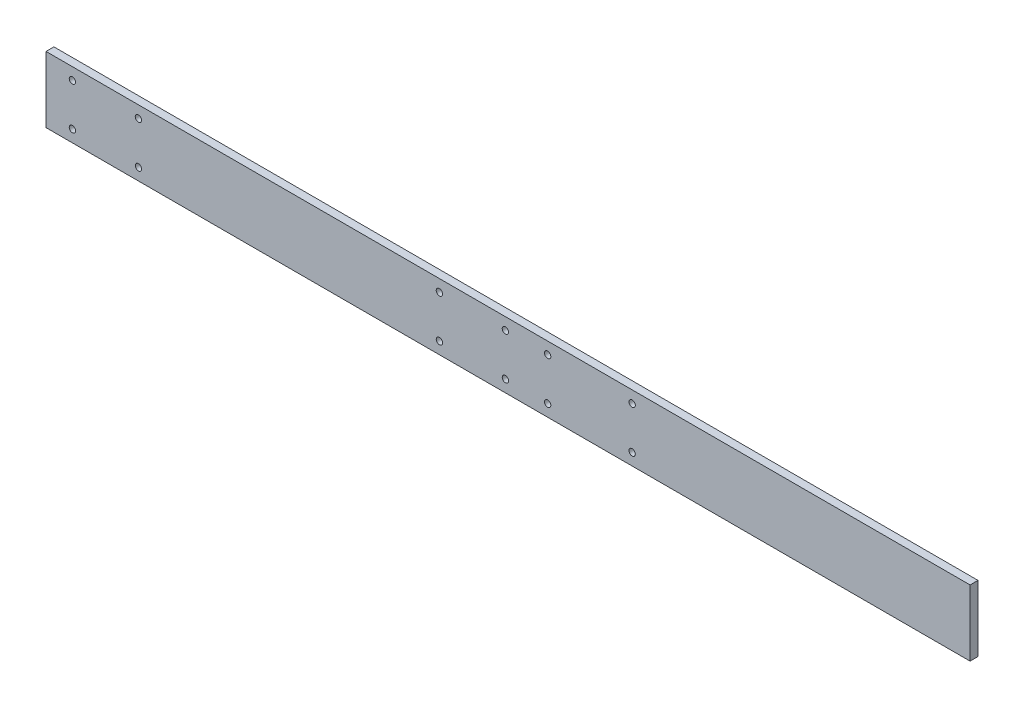
ISO-10303-21;
HEADER;
FILE_DESCRIPTION(('STEP AP214'),'2;1');
FILE_NAME('part.step','',(''),(''),'','','');
FILE_SCHEMA(('AUTOMOTIVE_DESIGN { 1 0 10303 214 1 1 1 1 }'));
ENDSEC;
DATA;
#1=APPLICATION_CONTEXT('core data for automotive mechanical design processes');
#2=APPLICATION_PROTOCOL_DEFINITION('international standard','automotive_design',2000,#1);
#3=PRODUCT_CONTEXT('',#1,'mechanical');
#4=PRODUCT('Part','Part','',(#3));
#5=PRODUCT_RELATED_PRODUCT_CATEGORY('part','',(#4));
#6=PRODUCT_DEFINITION_FORMATION('','',#4);
#7=PRODUCT_DEFINITION_CONTEXT('part definition',#1,'design');
#8=PRODUCT_DEFINITION('design','',#6,#7);
#9=PRODUCT_DEFINITION_SHAPE('','',#8);
#10=(LENGTH_UNIT() NAMED_UNIT(*) SI_UNIT(.MILLI.,.METRE.));
#11=(NAMED_UNIT(*) PLANE_ANGLE_UNIT() SI_UNIT($,.RADIAN.));
#12=(NAMED_UNIT(*) SI_UNIT($,.STERADIAN.) SOLID_ANGLE_UNIT());
#13=UNCERTAINTY_MEASURE_WITH_UNIT(LENGTH_MEASURE(1.E-05),#10,'distance_accuracy_value','');
#14=(GEOMETRIC_REPRESENTATION_CONTEXT(3) GLOBAL_UNCERTAINTY_ASSIGNED_CONTEXT((#13)) GLOBAL_UNIT_ASSIGNED_CONTEXT((#10,
#11,#12)) REPRESENTATION_CONTEXT('',''));
#15=CARTESIAN_POINT('',(0.,0.,0.));
#16=DIRECTION('',(0.,0.,1.));
#17=DIRECTION('',(1.,0.,0.));
#18=AXIS2_PLACEMENT_3D('',#15,#16,#17);
#19=CARTESIAN_POINT('',(0.,1.065814E-13,0.));
#20=DIRECTION('',(0.,0.,1.));
#21=DIRECTION('',(1.,0.,0.));
#22=AXIS2_PLACEMENT_3D('',#19,#20,#21);
#23=PLANE('',#22);
#24=CARTESIAN_POINT('',(150.,-80.,0.));
#25=DIRECTION('',(0.,0.,-1.));
#26=DIRECTION('',(-1.,0.,0.));
#27=AXIS2_PLACEMENT_3D('',#24,#25,#26);
#28=CIRCLE('',#27,12.);
#29=CARTESIAN_POINT('',(138.,-80.,0.));
#30=VERTEX_POINT('',#29);
#31=EDGE_CURVE('E115',#30,#30,#28,.F.);
#32=ORIENTED_EDGE('',*,*,#31,.T.);
#33=EDGE_LOOP('',(#32));
#34=FACE_BOUND('',#33,.T.);
#35=CARTESIAN_POINT('',(470.,-80.0000000000001,0.));
#36=DIRECTION('',(0.,0.,-1.));
#37=DIRECTION('',(-1.,0.,0.));
#38=AXIS2_PLACEMENT_3D('',#35,#36,#37);
#39=CIRCLE('',#38,11.9999999999999);
#40=CARTESIAN_POINT('',(458.,-80.0000000000001,0.));
#41=VERTEX_POINT('',#40);
#42=EDGE_CURVE('E119',#41,#41,#39,.F.);
#43=ORIENTED_EDGE('',*,*,#42,.T.);
#44=EDGE_LOOP('',(#43));
#45=FACE_BOUND('',#44,.T.);
#46=CARTESIAN_POINT('',(150.,80.,0.));
#47=DIRECTION('',(0.,0.,-1.));
#48=DIRECTION('',(-1.,0.,0.));
#49=AXIS2_PLACEMENT_3D('',#46,#47,#48);
#50=CIRCLE('',#49,12.);
#51=CARTESIAN_POINT('',(138.,80.,0.));
#52=VERTEX_POINT('',#51);
#53=EDGE_CURVE('E122',#52,#52,#50,.F.);
#54=ORIENTED_EDGE('',*,*,#53,.T.);
#55=EDGE_LOOP('',(#54));
#56=FACE_BOUND('',#55,.T.);
#57=CARTESIAN_POINT('',(470.,80.,0.));
#58=DIRECTION('',(0.,0.,-1.));
#59=DIRECTION('',(-1.,0.,0.));
#60=AXIS2_PLACEMENT_3D('',#57,#58,#59);
#61=CIRCLE('',#60,11.9999999999999);
#62=CARTESIAN_POINT('',(458.,80.,0.));
#63=VERTEX_POINT('',#62);
#64=EDGE_CURVE('E125',#63,#63,#61,.F.);
#65=ORIENTED_EDGE('',*,*,#64,.T.);
#66=EDGE_LOOP('',(#65));
#67=FACE_BOUND('',#66,.T.);
#68=CARTESIAN_POINT('',(-1650.,-80.0000000000002,0.));
#69=DIRECTION('',(0.,0.,-1.));
#70=DIRECTION('',(-1.,0.,0.));
#71=AXIS2_PLACEMENT_3D('',#68,#69,#70);
#72=CIRCLE('',#71,12.);
#73=CARTESIAN_POINT('',(-1662.,-80.0000000000002,0.));
#74=VERTEX_POINT('',#73);
#75=EDGE_CURVE('E128',#74,#74,#72,.F.);
#76=ORIENTED_EDGE('',*,*,#75,.T.);
#77=EDGE_LOOP('',(#76));
#78=FACE_BOUND('',#77,.T.);
#79=CARTESIAN_POINT('',(-1650.,79.9999999999998,0.));
#80=DIRECTION('',(0.,0.,-1.));
#81=DIRECTION('',(-1.,0.,0.));
#82=AXIS2_PLACEMENT_3D('',#79,#80,#81);
#83=CIRCLE('',#82,11.9999999999999);
#84=CARTESIAN_POINT('',(-1662.,79.9999999999998,0.));
#85=VERTEX_POINT('',#84);
#86=EDGE_CURVE('E131',#85,#85,#83,.F.);
#87=ORIENTED_EDGE('',*,*,#86,.T.);
#88=EDGE_LOOP('',(#87));
#89=FACE_BOUND('',#88,.T.);
#90=CARTESIAN_POINT('',(-1400.,-80.,0.));
#91=DIRECTION('',(0.,0.,-1.));
#92=DIRECTION('',(-1.,0.,0.));
#93=AXIS2_PLACEMENT_3D('',#90,#91,#92);
#94=CIRCLE('',#93,12.);
#95=CARTESIAN_POINT('',(-1412.,-80.,0.));
#96=VERTEX_POINT('',#95);
#97=EDGE_CURVE('E134',#96,#96,#94,.F.);
#98=ORIENTED_EDGE('',*,*,#97,.T.);
#99=EDGE_LOOP('',(#98));
#100=FACE_BOUND('',#99,.T.);
#101=CARTESIAN_POINT('',(-1400.,80.,0.));
#102=DIRECTION('',(0.,0.,-1.));
#103=DIRECTION('',(-1.,0.,0.));
#104=AXIS2_PLACEMENT_3D('',#101,#102,#103);
#105=CIRCLE('',#104,11.9999999999999);
#106=CARTESIAN_POINT('',(-1412.,80.,0.));
#107=VERTEX_POINT('',#106);
#108=EDGE_CURVE('E137',#107,#107,#105,.F.);
#109=ORIENTED_EDGE('',*,*,#108,.T.);
#110=EDGE_LOOP('',(#109));
#111=FACE_BOUND('',#110,.T.);
#112=CARTESIAN_POINT('',(-260.,-79.9999999999998,0.));
#113=DIRECTION('',(0.,0.,-1.));
#114=DIRECTION('',(-1.,0.,0.));
#115=AXIS2_PLACEMENT_3D('',#112,#113,#114);
#116=CIRCLE('',#115,12.);
#117=CARTESIAN_POINT('',(-272.,-79.9999999999998,0.));
#118=VERTEX_POINT('',#117);
#119=EDGE_CURVE('E140',#118,#118,#116,.F.);
#120=ORIENTED_EDGE('',*,*,#119,.T.);
#121=EDGE_LOOP('',(#120));
#122=FACE_BOUND('',#121,.T.);
#123=CARTESIAN_POINT('',(-260.,80.0000000000002,0.));
#124=DIRECTION('',(0.,0.,-1.));
#125=DIRECTION('',(-1.,0.,0.));
#126=AXIS2_PLACEMENT_3D('',#123,#124,#125);
#127=CIRCLE('',#126,12.);
#128=CARTESIAN_POINT('',(-272.,80.0000000000002,0.));
#129=VERTEX_POINT('',#128);
#130=EDGE_CURVE('E143',#129,#129,#127,.F.);
#131=ORIENTED_EDGE('',*,*,#130,.T.);
#132=EDGE_LOOP('',(#131));
#133=FACE_BOUND('',#132,.T.);
#134=CARTESIAN_POINT('',(-10.,-79.9999999999998,0.));
#135=DIRECTION('',(0.,0.,-1.));
#136=DIRECTION('',(-1.,0.,0.));
#137=AXIS2_PLACEMENT_3D('',#134,#135,#136);
#138=CIRCLE('',#137,12.);
#139=CARTESIAN_POINT('',(-22.,-79.9999999999998,0.));
#140=VERTEX_POINT('',#139);
#141=EDGE_CURVE('E145',#140,#140,#138,.F.);
#142=ORIENTED_EDGE('',*,*,#141,.T.);
#143=EDGE_LOOP('',(#142));
#144=FACE_BOUND('',#143,.T.);
#145=CARTESIAN_POINT('',(-10.,80.0000000000002,0.));
#146=DIRECTION('',(0.,0.,-1.));
#147=DIRECTION('',(-1.,0.,0.));
#148=AXIS2_PLACEMENT_3D('',#145,#146,#147);
#149=CIRCLE('',#148,12.);
#150=CARTESIAN_POINT('',(-22.,80.0000000000002,0.));
#151=VERTEX_POINT('',#150);
#152=EDGE_CURVE('E21',#151,#151,#149,.F.);
#153=ORIENTED_EDGE('',*,*,#152,.T.);
#154=EDGE_LOOP('',(#153));
#155=FACE_BOUND('',#154,.T.);
#156=DIRECTION('',(0.,1.,0.));
#157=VECTOR('',#156,1.);
#158=CARTESIAN_POINT('',(1750.,125.,0.));
#159=LINE('',#158,#157);
#160=CARTESIAN_POINT('',(1750.,-125.,0.));
#161=VERTEX_POINT('',#160);
#162=CARTESIAN_POINT('',(1750.,125.,0.));
#163=VERTEX_POINT('',#162);
#164=EDGE_CURVE('E61',#161,#163,#159,.T.);
#165=ORIENTED_EDGE('',*,*,#164,.F.);
#166=DIRECTION('',(1.,0.,0.));
#167=VECTOR('',#166,1.);
#168=CARTESIAN_POINT('',(1750.,-125.,0.));
#169=LINE('',#168,#167);
#170=CARTESIAN_POINT('',(-1750.,-125.,0.));
#171=VERTEX_POINT('',#170);
#172=EDGE_CURVE('E152',#171,#161,#169,.T.);
#173=ORIENTED_EDGE('',*,*,#172,.F.);
#174=DIRECTION('',(0.,1.,0.));
#175=VECTOR('',#174,1.);
#176=CARTESIAN_POINT('',(-1750.,-125.,0.));
#177=LINE('',#176,#175);
#178=CARTESIAN_POINT('',(-1750.,125.,0.));
#179=VERTEX_POINT('',#178);
#180=EDGE_CURVE('E71',#179,#171,#177,.F.);
#181=ORIENTED_EDGE('',*,*,#180,.F.);
#182=DIRECTION('',(1.,0.,0.));
#183=VECTOR('',#182,1.);
#184=CARTESIAN_POINT('',(-1750.,125.,0.));
#185=LINE('',#184,#183);
#186=EDGE_CURVE('E56',#163,#179,#185,.F.);
#187=ORIENTED_EDGE('',*,*,#186,.F.);
#188=EDGE_LOOP('',(#165,#173,#181,#187));
#189=FACE_BOUND('',#188,.T.);
#190=ADVANCED_FACE('F17',(#34,#45,#56,#67,#78,#89,#100,#111,#122,#133,#144,#155,#189),#23,.F.);
#191=CARTESIAN_POINT('',(1750.,125.,0.));
#192=DIRECTION('',(1.,0.,0.));
#193=DIRECTION('',(0.,0.,-1.));
#194=AXIS2_PLACEMENT_3D('',#191,#192,#193);
#195=PLANE('',#194);
#196=ORIENTED_EDGE('',*,*,#164,.T.);
#197=DIRECTION('',(0.,0.,1.));
#198=VECTOR('',#197,1.);
#199=CARTESIAN_POINT('',(1750.,125.,0.));
#200=LINE('',#199,#198);
#201=CARTESIAN_POINT('',(1750.,125.,30.));
#202=VERTEX_POINT('',#201);
#203=EDGE_CURVE('E63',#202,#163,#200,.F.);
#204=ORIENTED_EDGE('',*,*,#203,.F.);
#205=DIRECTION('',(0.,1.,0.));
#206=VECTOR('',#205,1.);
#207=CARTESIAN_POINT('',(1750.,1.050204E-13,30.));
#208=LINE('',#207,#206);
#209=CARTESIAN_POINT('',(1750.,-125.,30.));
#210=VERTEX_POINT('',#209);
#211=EDGE_CURVE('E118',#210,#202,#208,.T.);
#212=ORIENTED_EDGE('',*,*,#211,.F.);
#213=DIRECTION('',(0.,0.,-1.));
#214=VECTOR('',#213,1.);
#215=CARTESIAN_POINT('',(1750.,-125.,0.));
#216=LINE('',#215,#214);
#217=EDGE_CURVE('E66',#161,#210,#216,.F.);
#218=ORIENTED_EDGE('',*,*,#217,.F.);
#219=EDGE_LOOP('',(#196,#204,#212,#218));
#220=FACE_BOUND('',#219,.T.);
#221=ADVANCED_FACE('F62',(#220),#195,.T.);
#222=CARTESIAN_POINT('',(-1750.,125.,0.));
#223=DIRECTION('',(0.,1.,0.));
#224=DIRECTION('',(0.,0.,1.));
#225=AXIS2_PLACEMENT_3D('',#222,#223,#224);
#226=PLANE('',#225);
#227=ORIENTED_EDGE('',*,*,#186,.T.);
#228=DIRECTION('',(0.,0.,1.));
#229=VECTOR('',#228,1.);
#230=CARTESIAN_POINT('',(-1750.,125.,0.));
#231=LINE('',#230,#229);
#232=CARTESIAN_POINT('',(-1750.,125.,30.));
#233=VERTEX_POINT('',#232);
#234=EDGE_CURVE('E73',#233,#179,#231,.F.);
#235=ORIENTED_EDGE('',*,*,#234,.F.);
#236=DIRECTION('',(1.,0.,0.));
#237=VECTOR('',#236,1.);
#238=CARTESIAN_POINT('',(0.,125.,30.));
#239=LINE('',#238,#237);
#240=EDGE_CURVE('E77',#202,#233,#239,.F.);
#241=ORIENTED_EDGE('',*,*,#240,.F.);
#242=ORIENTED_EDGE('',*,*,#203,.T.);
#243=EDGE_LOOP('',(#227,#235,#241,#242));
#244=FACE_BOUND('',#243,.T.);
#245=ADVANCED_FACE('F75',(#244),#226,.T.);
#246=CARTESIAN_POINT('',(-1750.,-125.,0.));
#247=DIRECTION('',(-1.,0.,0.));
#248=DIRECTION('',(0.,0.,1.));
#249=AXIS2_PLACEMENT_3D('',#246,#247,#248);
#250=PLANE('',#249);
#251=ORIENTED_EDGE('',*,*,#180,.T.);
#252=DIRECTION('',(0.,0.,-1.));
#253=VECTOR('',#252,1.);
#254=CARTESIAN_POINT('',(-1750.,-125.,0.));
#255=LINE('',#254,#253);
#256=CARTESIAN_POINT('',(-1750.,-125.,30.));
#257=VERTEX_POINT('',#256);
#258=EDGE_CURVE('E36',#257,#171,#255,.T.);
#259=ORIENTED_EDGE('',*,*,#258,.F.);
#260=DIRECTION('',(0.,1.,0.));
#261=VECTOR('',#260,1.);
#262=CARTESIAN_POINT('',(-1750.,1.050204E-13,30.));
#263=LINE('',#262,#261);
#264=EDGE_CURVE('E163',#233,#257,#263,.F.);
#265=ORIENTED_EDGE('',*,*,#264,.F.);
#266=ORIENTED_EDGE('',*,*,#234,.T.);
#267=EDGE_LOOP('',(#251,#259,#265,#266));
#268=FACE_BOUND('',#267,.T.);
#269=ADVANCED_FACE('F161',(#268),#250,.T.);
#270=CARTESIAN_POINT('',(1750.,-125.,0.));
#271=DIRECTION('',(0.,-1.,0.));
#272=DIRECTION('',(0.,0.,-1.));
#273=AXIS2_PLACEMENT_3D('',#270,#271,#272);
#274=PLANE('',#273);
#275=ORIENTED_EDGE('',*,*,#172,.T.);
#276=ORIENTED_EDGE('',*,*,#217,.T.);
#277=DIRECTION('',(1.,0.,0.));
#278=VECTOR('',#277,1.);
#279=CARTESIAN_POINT('',(0.,-125.,30.));
#280=LINE('',#279,#278);
#281=EDGE_CURVE('E114',#257,#210,#280,.T.);
#282=ORIENTED_EDGE('',*,*,#281,.F.);
#283=ORIENTED_EDGE('',*,*,#258,.T.);
#284=EDGE_LOOP('',(#275,#276,#282,#283));
#285=FACE_BOUND('',#284,.T.);
#286=ADVANCED_FACE('F168',(#285),#274,.T.);
#287=CARTESIAN_POINT('',(-10.,80.0000000000002,30.));
#288=DIRECTION('',(0.,0.,-1.));
#289=DIRECTION('',(-1.,0.,0.));
#290=AXIS2_PLACEMENT_3D('',#287,#288,#289);
#291=CYLINDRICAL_SURFACE('',#290,12.);
#292=ORIENTED_EDGE('',*,*,#152,.F.);
#293=EDGE_LOOP('',(#292));
#294=FACE_BOUND('',#293,.T.);
#295=CARTESIAN_POINT('',(-10.,80.0000000000002,30.));
#296=DIRECTION('',(0.,0.,-1.));
#297=DIRECTION('',(-1.,0.,0.));
#298=AXIS2_PLACEMENT_3D('',#295,#296,#297);
#299=CIRCLE('',#298,12.);
#300=CARTESIAN_POINT('',(-22.,80.0000000000002,30.));
#301=VERTEX_POINT('',#300);
#302=EDGE_CURVE('E111',#301,#301,#299,.T.);
#303=ORIENTED_EDGE('',*,*,#302,.F.);
#304=EDGE_LOOP('',(#303));
#305=FACE_BOUND('',#304,.T.);
#306=ADVANCED_FACE('F170',(#294,#305),#291,.F.);
#307=CARTESIAN_POINT('',(-10.,-79.9999999999998,30.));
#308=DIRECTION('',(0.,0.,-1.));
#309=DIRECTION('',(-1.,0.,0.));
#310=AXIS2_PLACEMENT_3D('',#307,#308,#309);
#311=CYLINDRICAL_SURFACE('',#310,12.);
#312=ORIENTED_EDGE('',*,*,#141,.F.);
#313=EDGE_LOOP('',(#312));
#314=FACE_BOUND('',#313,.T.);
#315=CARTESIAN_POINT('',(-10.,-79.9999999999998,30.));
#316=DIRECTION('',(0.,0.,-1.));
#317=DIRECTION('',(-1.,0.,0.));
#318=AXIS2_PLACEMENT_3D('',#315,#316,#317);
#319=CIRCLE('',#318,12.);
#320=CARTESIAN_POINT('',(-22.,-79.9999999999998,30.));
#321=VERTEX_POINT('',#320);
#322=EDGE_CURVE('E108',#321,#321,#319,.T.);
#323=ORIENTED_EDGE('',*,*,#322,.F.);
#324=EDGE_LOOP('',(#323));
#325=FACE_BOUND('',#324,.T.);
#326=ADVANCED_FACE('F177',(#314,#325),#311,.F.);
#327=CARTESIAN_POINT('',(-260.,80.0000000000002,30.));
#328=DIRECTION('',(0.,0.,-1.));
#329=DIRECTION('',(-1.,0.,0.));
#330=AXIS2_PLACEMENT_3D('',#327,#328,#329);
#331=CYLINDRICAL_SURFACE('',#330,12.);
#332=ORIENTED_EDGE('',*,*,#130,.F.);
#333=EDGE_LOOP('',(#332));
#334=FACE_BOUND('',#333,.T.);
#335=CARTESIAN_POINT('',(-260.,80.0000000000002,30.));
#336=DIRECTION('',(0.,0.,-1.));
#337=DIRECTION('',(-1.,0.,0.));
#338=AXIS2_PLACEMENT_3D('',#335,#336,#337);
#339=CIRCLE('',#338,12.);
#340=CARTESIAN_POINT('',(-272.,80.0000000000002,30.));
#341=VERTEX_POINT('',#340);
#342=EDGE_CURVE('E105',#341,#341,#339,.T.);
#343=ORIENTED_EDGE('',*,*,#342,.F.);
#344=EDGE_LOOP('',(#343));
#345=FACE_BOUND('',#344,.T.);
#346=ADVANCED_FACE('F215',(#334,#345),#331,.F.);
#347=CARTESIAN_POINT('',(-260.,-79.9999999999998,30.));
#348=DIRECTION('',(0.,0.,-1.));
#349=DIRECTION('',(-1.,0.,0.));
#350=AXIS2_PLACEMENT_3D('',#347,#348,#349);
#351=CYLINDRICAL_SURFACE('',#350,12.);
#352=ORIENTED_EDGE('',*,*,#119,.F.);
#353=EDGE_LOOP('',(#352));
#354=FACE_BOUND('',#353,.T.);
#355=CARTESIAN_POINT('',(-260.,-79.9999999999998,30.));
#356=DIRECTION('',(0.,0.,-1.));
#357=DIRECTION('',(-1.,0.,0.));
#358=AXIS2_PLACEMENT_3D('',#355,#356,#357);
#359=CIRCLE('',#358,12.);
#360=CARTESIAN_POINT('',(-272.,-79.9999999999998,30.));
#361=VERTEX_POINT('',#360);
#362=EDGE_CURVE('E102',#361,#361,#359,.T.);
#363=ORIENTED_EDGE('',*,*,#362,.F.);
#364=EDGE_LOOP('',(#363));
#365=FACE_BOUND('',#364,.T.);
#366=ADVANCED_FACE('F221',(#354,#365),#351,.F.);
#367=CARTESIAN_POINT('',(-1400.,80.,30.));
#368=DIRECTION('',(0.,0.,-1.));
#369=DIRECTION('',(-1.,0.,0.));
#370=AXIS2_PLACEMENT_3D('',#367,#368,#369);
#371=CYLINDRICAL_SURFACE('',#370,11.9999999999999);
#372=ORIENTED_EDGE('',*,*,#108,.F.);
#373=EDGE_LOOP('',(#372));
#374=FACE_BOUND('',#373,.T.);
#375=CARTESIAN_POINT('',(-1400.,80.,30.));
#376=DIRECTION('',(0.,0.,-1.));
#377=DIRECTION('',(-1.,0.,0.));
#378=AXIS2_PLACEMENT_3D('',#375,#376,#377);
#379=CIRCLE('',#378,11.9999999999999);
#380=CARTESIAN_POINT('',(-1412.,80.,30.));
#381=VERTEX_POINT('',#380);
#382=EDGE_CURVE('E99',#381,#381,#379,.T.);
#383=ORIENTED_EDGE('',*,*,#382,.F.);
#384=EDGE_LOOP('',(#383));
#385=FACE_BOUND('',#384,.T.);
#386=ADVANCED_FACE('F228',(#374,#385),#371,.F.);
#387=CARTESIAN_POINT('',(-1400.,-80.,30.));
#388=DIRECTION('',(0.,0.,-1.));
#389=DIRECTION('',(-1.,0.,0.));
#390=AXIS2_PLACEMENT_3D('',#387,#388,#389);
#391=CYLINDRICAL_SURFACE('',#390,12.);
#392=ORIENTED_EDGE('',*,*,#97,.F.);
#393=EDGE_LOOP('',(#392));
#394=FACE_BOUND('',#393,.T.);
#395=CARTESIAN_POINT('',(-1400.,-80.,30.));
#396=DIRECTION('',(0.,0.,-1.));
#397=DIRECTION('',(-1.,0.,0.));
#398=AXIS2_PLACEMENT_3D('',#395,#396,#397);
#399=CIRCLE('',#398,12.);
#400=CARTESIAN_POINT('',(-1412.,-80.,30.));
#401=VERTEX_POINT('',#400);
#402=EDGE_CURVE('E96',#401,#401,#399,.T.);
#403=ORIENTED_EDGE('',*,*,#402,.F.);
#404=EDGE_LOOP('',(#403));
#405=FACE_BOUND('',#404,.T.);
#406=ADVANCED_FACE('F232',(#394,#405),#391,.F.);
#407=CARTESIAN_POINT('',(-1650.,79.9999999999998,30.));
#408=DIRECTION('',(0.,0.,-1.));
#409=DIRECTION('',(-1.,0.,0.));
#410=AXIS2_PLACEMENT_3D('',#407,#408,#409);
#411=CYLINDRICAL_SURFACE('',#410,11.9999999999999);
#412=ORIENTED_EDGE('',*,*,#86,.F.);
#413=EDGE_LOOP('',(#412));
#414=FACE_BOUND('',#413,.T.);
#415=CARTESIAN_POINT('',(-1650.,79.9999999999998,30.));
#416=DIRECTION('',(0.,0.,-1.));
#417=DIRECTION('',(-1.,0.,0.));
#418=AXIS2_PLACEMENT_3D('',#415,#416,#417);
#419=CIRCLE('',#418,11.9999999999999);
#420=CARTESIAN_POINT('',(-1662.,79.9999999999998,30.));
#421=VERTEX_POINT('',#420);
#422=EDGE_CURVE('E93',#421,#421,#419,.T.);
#423=ORIENTED_EDGE('',*,*,#422,.F.);
#424=EDGE_LOOP('',(#423));
#425=FACE_BOUND('',#424,.T.);
#426=ADVANCED_FACE('F236',(#414,#425),#411,.F.);
#427=CARTESIAN_POINT('',(-1650.,-80.0000000000002,30.));
#428=DIRECTION('',(0.,0.,-1.));
#429=DIRECTION('',(-1.,0.,0.));
#430=AXIS2_PLACEMENT_3D('',#427,#428,#429);
#431=CYLINDRICAL_SURFACE('',#430,12.);
#432=ORIENTED_EDGE('',*,*,#75,.F.);
#433=EDGE_LOOP('',(#432));
#434=FACE_BOUND('',#433,.T.);
#435=CARTESIAN_POINT('',(-1650.,-80.0000000000002,30.));
#436=DIRECTION('',(0.,0.,-1.));
#437=DIRECTION('',(-1.,0.,0.));
#438=AXIS2_PLACEMENT_3D('',#435,#436,#437);
#439=CIRCLE('',#438,12.);
#440=CARTESIAN_POINT('',(-1662.,-80.0000000000002,30.));
#441=VERTEX_POINT('',#440);
#442=EDGE_CURVE('E90',#441,#441,#439,.T.);
#443=ORIENTED_EDGE('',*,*,#442,.F.);
#444=EDGE_LOOP('',(#443));
#445=FACE_BOUND('',#444,.T.);
#446=ADVANCED_FACE('F240',(#434,#445),#431,.F.);
#447=CARTESIAN_POINT('',(470.,80.,30.));
#448=DIRECTION('',(0.,0.,-1.));
#449=DIRECTION('',(-1.,0.,0.));
#450=AXIS2_PLACEMENT_3D('',#447,#448,#449);
#451=CYLINDRICAL_SURFACE('',#450,11.9999999999999);
#452=ORIENTED_EDGE('',*,*,#64,.F.);
#453=EDGE_LOOP('',(#452));
#454=FACE_BOUND('',#453,.T.);
#455=CARTESIAN_POINT('',(470.,80.,30.));
#456=DIRECTION('',(0.,0.,-1.));
#457=DIRECTION('',(-1.,0.,0.));
#458=AXIS2_PLACEMENT_3D('',#455,#456,#457);
#459=CIRCLE('',#458,11.9999999999999);
#460=CARTESIAN_POINT('',(458.,80.,30.));
#461=VERTEX_POINT('',#460);
#462=EDGE_CURVE('E87',#461,#461,#459,.T.);
#463=ORIENTED_EDGE('',*,*,#462,.F.);
#464=EDGE_LOOP('',(#463));
#465=FACE_BOUND('',#464,.T.);
#466=ADVANCED_FACE('F244',(#454,#465),#451,.F.);
#467=CARTESIAN_POINT('',(150.,80.,30.));
#468=DIRECTION('',(0.,0.,-1.));
#469=DIRECTION('',(-1.,0.,0.));
#470=AXIS2_PLACEMENT_3D('',#467,#468,#469);
#471=CYLINDRICAL_SURFACE('',#470,12.);
#472=ORIENTED_EDGE('',*,*,#53,.F.);
#473=EDGE_LOOP('',(#472));
#474=FACE_BOUND('',#473,.T.);
#475=CARTESIAN_POINT('',(150.,80.,30.));
#476=DIRECTION('',(0.,0.,-1.));
#477=DIRECTION('',(-1.,0.,0.));
#478=AXIS2_PLACEMENT_3D('',#475,#476,#477);
#479=CIRCLE('',#478,12.);
#480=CARTESIAN_POINT('',(138.,80.,30.));
#481=VERTEX_POINT('',#480);
#482=EDGE_CURVE('E84',#481,#481,#479,.T.);
#483=ORIENTED_EDGE('',*,*,#482,.F.);
#484=EDGE_LOOP('',(#483));
#485=FACE_BOUND('',#484,.T.);
#486=ADVANCED_FACE('F248',(#474,#485),#471,.F.);
#487=CARTESIAN_POINT('',(470.,-80.0000000000001,30.));
#488=DIRECTION('',(0.,0.,-1.));
#489=DIRECTION('',(-1.,0.,0.));
#490=AXIS2_PLACEMENT_3D('',#487,#488,#489);
#491=CYLINDRICAL_SURFACE('',#490,11.9999999999999);
#492=ORIENTED_EDGE('',*,*,#42,.F.);
#493=EDGE_LOOP('',(#492));
#494=FACE_BOUND('',#493,.T.);
#495=CARTESIAN_POINT('',(470.,-80.0000000000001,30.));
#496=DIRECTION('',(0.,0.,-1.));
#497=DIRECTION('',(-1.,0.,0.));
#498=AXIS2_PLACEMENT_3D('',#495,#496,#497);
#499=CIRCLE('',#498,11.9999999999999);
#500=CARTESIAN_POINT('',(458.,-80.0000000000001,30.));
#501=VERTEX_POINT('',#500);
#502=EDGE_CURVE('E27',#501,#501,#499,.T.);
#503=ORIENTED_EDGE('',*,*,#502,.F.);
#504=EDGE_LOOP('',(#503));
#505=FACE_BOUND('',#504,.T.);
#506=ADVANCED_FACE('F187',(#494,#505),#491,.F.);
#507=CARTESIAN_POINT('',(150.,-80.,30.));
#508=DIRECTION('',(0.,0.,-1.));
#509=DIRECTION('',(-1.,0.,0.));
#510=AXIS2_PLACEMENT_3D('',#507,#508,#509);
#511=CYLINDRICAL_SURFACE('',#510,12.);
#512=ORIENTED_EDGE('',*,*,#31,.F.);
#513=EDGE_LOOP('',(#512));
#514=FACE_BOUND('',#513,.T.);
#515=CARTESIAN_POINT('',(150.,-80.,30.));
#516=DIRECTION('',(0.,0.,-1.));
#517=DIRECTION('',(-1.,0.,0.));
#518=AXIS2_PLACEMENT_3D('',#515,#516,#517);
#519=CIRCLE('',#518,12.);
#520=CARTESIAN_POINT('',(138.,-80.,30.));
#521=VERTEX_POINT('',#520);
#522=EDGE_CURVE('E11',#521,#521,#519,.T.);
#523=ORIENTED_EDGE('',*,*,#522,.F.);
#524=EDGE_LOOP('',(#523));
#525=FACE_BOUND('',#524,.T.);
#526=ADVANCED_FACE('F19',(#514,#525),#511,.F.);
#527=CARTESIAN_POINT('',(0.,1.050204E-13,30.));
#528=DIRECTION('',(0.,0.,1.));
#529=DIRECTION('',(1.,0.,0.));
#530=AXIS2_PLACEMENT_3D('',#527,#528,#529);
#531=PLANE('',#530);
#532=ORIENTED_EDGE('',*,*,#522,.T.);
#533=EDGE_LOOP('',(#532));
#534=FACE_BOUND('',#533,.T.);
#535=ORIENTED_EDGE('',*,*,#502,.T.);
#536=EDGE_LOOP('',(#535));
#537=FACE_BOUND('',#536,.T.);
#538=ORIENTED_EDGE('',*,*,#482,.T.);
#539=EDGE_LOOP('',(#538));
#540=FACE_BOUND('',#539,.T.);
#541=ORIENTED_EDGE('',*,*,#462,.T.);
#542=EDGE_LOOP('',(#541));
#543=FACE_BOUND('',#542,.T.);
#544=ORIENTED_EDGE('',*,*,#442,.T.);
#545=EDGE_LOOP('',(#544));
#546=FACE_BOUND('',#545,.T.);
#547=ORIENTED_EDGE('',*,*,#422,.T.);
#548=EDGE_LOOP('',(#547));
#549=FACE_BOUND('',#548,.T.);
#550=ORIENTED_EDGE('',*,*,#402,.T.);
#551=EDGE_LOOP('',(#550));
#552=FACE_BOUND('',#551,.T.);
#553=ORIENTED_EDGE('',*,*,#382,.T.);
#554=EDGE_LOOP('',(#553));
#555=FACE_BOUND('',#554,.T.);
#556=ORIENTED_EDGE('',*,*,#362,.T.);
#557=EDGE_LOOP('',(#556));
#558=FACE_BOUND('',#557,.T.);
#559=ORIENTED_EDGE('',*,*,#342,.T.);
#560=EDGE_LOOP('',(#559));
#561=FACE_BOUND('',#560,.T.);
#562=ORIENTED_EDGE('',*,*,#322,.T.);
#563=EDGE_LOOP('',(#562));
#564=FACE_BOUND('',#563,.T.);
#565=ORIENTED_EDGE('',*,*,#302,.T.);
#566=EDGE_LOOP('',(#565));
#567=FACE_BOUND('',#566,.T.);
#568=ORIENTED_EDGE('',*,*,#264,.T.);
#569=ORIENTED_EDGE('',*,*,#281,.T.);
#570=ORIENTED_EDGE('',*,*,#211,.T.);
#571=ORIENTED_EDGE('',*,*,#240,.T.);
#572=EDGE_LOOP('',(#568,#569,#570,#571));
#573=FACE_BOUND('',#572,.T.);
#574=ADVANCED_FACE('F166',(#534,#537,#540,#543,#546,#549,#552,#555,#558,#561,#564,#567,#573),
#531,.T.);
#575=CLOSED_SHELL('',(#190,#221,#245,#269,#286,#306,#326,#346,#366,#386,#406,#426,#446,#466,
#486,#506,#526,#574));
#576=MANIFOLD_SOLID_BREP('B1',#575);
#577=ADVANCED_BREP_SHAPE_REPRESENTATION('',(#18,#576),#14);
#578=SHAPE_DEFINITION_REPRESENTATION(#9,#577);
ENDSEC;
END-ISO-10303-21;
